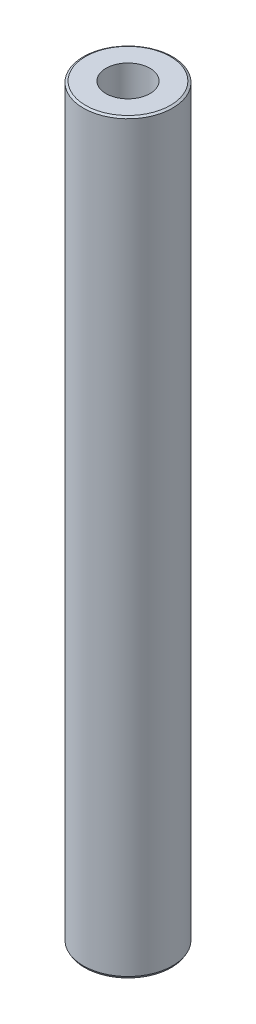
ISO-10303-21;
HEADER;
FILE_DESCRIPTION(('STEP AP214'),'2;1');
FILE_NAME('part.step','',(''),(''),'','','');
FILE_SCHEMA(('AUTOMOTIVE_DESIGN { 1 0 10303 214 1 1 1 1 }'));
ENDSEC;
DATA;
#1=APPLICATION_CONTEXT('core data for automotive mechanical design processes');
#2=APPLICATION_PROTOCOL_DEFINITION('international standard','automotive_design',2000,#1);
#3=PRODUCT_CONTEXT('',#1,'mechanical');
#4=PRODUCT('Part','Part','',(#3));
#5=PRODUCT_RELATED_PRODUCT_CATEGORY('part','',(#4));
#6=PRODUCT_DEFINITION_FORMATION('','',#4);
#7=PRODUCT_DEFINITION_CONTEXT('part definition',#1,'design');
#8=PRODUCT_DEFINITION('design','',#6,#7);
#9=PRODUCT_DEFINITION_SHAPE('','',#8);
#10=(LENGTH_UNIT() NAMED_UNIT(*) SI_UNIT(.MILLI.,.METRE.));
#11=(NAMED_UNIT(*) PLANE_ANGLE_UNIT() SI_UNIT($,.RADIAN.));
#12=(NAMED_UNIT(*) SI_UNIT($,.STERADIAN.) SOLID_ANGLE_UNIT());
#13=UNCERTAINTY_MEASURE_WITH_UNIT(LENGTH_MEASURE(1.E-05),#10,'distance_accuracy_value','');
#14=(GEOMETRIC_REPRESENTATION_CONTEXT(3) GLOBAL_UNCERTAINTY_ASSIGNED_CONTEXT((#13)) GLOBAL_UNIT_ASSIGNED_CONTEXT((#10,
#11,#12)) REPRESENTATION_CONTEXT('',''));
#15=CARTESIAN_POINT('',(0.,0.,0.));
#16=DIRECTION('',(0.,0.,1.));
#17=DIRECTION('',(1.,0.,0.));
#18=AXIS2_PLACEMENT_3D('',#15,#16,#17);
#19=CARTESIAN_POINT('',(0.,502.179161113457,0.));
#20=DIRECTION('',(0.,-1.,0.));
#21=DIRECTION('',(0.,0.,-1.));
#22=AXIS2_PLACEMENT_3D('',#19,#20,#21);
#23=CYLINDRICAL_SURFACE('',#22,30.);
#24=CARTESIAN_POINT('',(0.,501.32159175393,0.));
#25=DIRECTION('',(0.,1.,0.));
#26=DIRECTION('',(0.,0.,1.));
#27=AXIS2_PLACEMENT_3D('',#24,#25,#26);
#28=CIRCLE('',#27,30.);
#29=CARTESIAN_POINT('',(0.,501.32159175393,30.));
#30=VERTEX_POINT('',#29);
#31=EDGE_CURVE('E50',#30,#30,#28,.F.);
#32=ORIENTED_EDGE('',*,*,#31,.T.);
#33=EDGE_LOOP('',(#32));
#34=FACE_BOUND('',#33,.T.);
#35=CARTESIAN_POINT('',(0.,1.48535370171465,0.));
#36=DIRECTION('',(0.,1.,0.));
#37=DIRECTION('',(0.,0.,1.));
#38=AXIS2_PLACEMENT_3D('',#35,#36,#37);
#39=CIRCLE('',#38,30.);
#40=CARTESIAN_POINT('',(0.,1.48535370171465,30.));
#41=VERTEX_POINT('',#40);
#42=EDGE_CURVE('E51',#41,#41,#39,.T.);
#43=ORIENTED_EDGE('',*,*,#42,.T.);
#44=EDGE_LOOP('',(#43));
#45=FACE_BOUND('',#44,.T.);
#46=ADVANCED_FACE('F39',(#34,#45),#23,.T.);
#47=CARTESIAN_POINT('',(0.,502.179161113457,0.));
#48=DIRECTION('',(0.,1.,0.));
#49=DIRECTION('',(0.,0.,1.));
#50=AXIS2_PLACEMENT_3D('',#47,#48,#49);
#51=PLANE('',#50);
#52=CARTESIAN_POINT('',(0.,502.179161113457,0.));
#53=DIRECTION('',(0.,1.,0.));
#54=DIRECTION('',(0.,0.,1.));
#55=AXIS2_PLACEMENT_3D('',#52,#53,#54);
#56=CIRCLE('',#55,28.5146462982854);
#57=CARTESIAN_POINT('',(0.,502.179161113457,28.5146462982854));
#58=VERTEX_POINT('',#57);
#59=EDGE_CURVE('E54',#58,#58,#56,.T.);
#60=ORIENTED_EDGE('',*,*,#59,.T.);
#61=EDGE_LOOP('',(#60));
#62=FACE_BOUND('',#61,.T.);
#63=CARTESIAN_POINT('',(0.,502.179161113457,0.));
#64=DIRECTION('',(0.,1.,0.));
#65=DIRECTION('',(0.,0.,1.));
#66=AXIS2_PLACEMENT_3D('',#63,#64,#65);
#67=CIRCLE('',#66,14.8070598079835);
#68=CARTESIAN_POINT('',(0.,502.179161113457,14.8070598079835));
#69=VERTEX_POINT('',#68);
#70=EDGE_CURVE('E58',#69,#69,#67,.T.);
#71=ORIENTED_EDGE('',*,*,#70,.F.);
#72=EDGE_LOOP('',(#71));
#73=FACE_BOUND('',#72,.T.);
#74=ADVANCED_FACE('F69',(#62,#73),#51,.T.);
#75=CARTESIAN_POINT('',(0.,0.,0.));
#76=DIRECTION('',(0.,1.,0.));
#77=DIRECTION('',(0.,0.,1.));
#78=AXIS2_PLACEMENT_3D('',#75,#76,#77);
#79=PLANE('',#78);
#80=CARTESIAN_POINT('',(0.,0.,0.));
#81=DIRECTION('',(0.,1.,0.));
#82=DIRECTION('',(0.,0.,1.));
#83=AXIS2_PLACEMENT_3D('',#80,#81,#82);
#84=CIRCLE('',#83,29.1424306404732);
#85=CARTESIAN_POINT('',(0.,0.,29.1424306404732));
#86=VERTEX_POINT('',#85);
#87=EDGE_CURVE('E10',#86,#86,#84,.F.);
#88=ORIENTED_EDGE('',*,*,#87,.T.);
#89=EDGE_LOOP('',(#88));
#90=FACE_BOUND('',#89,.T.);
#91=CARTESIAN_POINT('',(0.,0.,0.));
#92=DIRECTION('',(0.,1.,0.));
#93=DIRECTION('',(0.,0.,1.));
#94=AXIS2_PLACEMENT_3D('',#91,#92,#93);
#95=CIRCLE('',#94,14.8070598079835);
#96=CARTESIAN_POINT('',(0.,0.,14.8070598079835));
#97=VERTEX_POINT('',#96);
#98=EDGE_CURVE('E63',#97,#97,#95,.T.);
#99=ORIENTED_EDGE('',*,*,#98,.T.);
#100=EDGE_LOOP('',(#99));
#101=FACE_BOUND('',#100,.T.);
#102=ADVANCED_FACE('F75',(#90,#101),#79,.F.);
#103=CARTESIAN_POINT('',(0.,502.179161113457,0.));
#104=DIRECTION('',(0.,-1.,0.));
#105=DIRECTION('',(0.,0.,-1.));
#106=AXIS2_PLACEMENT_3D('',#103,#104,#105);
#107=CYLINDRICAL_SURFACE('',#106,14.8070598079835);
#108=ORIENTED_EDGE('',*,*,#70,.T.);
#109=EDGE_LOOP('',(#108));
#110=FACE_BOUND('',#109,.T.);
#111=ORIENTED_EDGE('',*,*,#98,.F.);
#112=EDGE_LOOP('',(#111));
#113=FACE_BOUND('',#112,.T.);
#114=ADVANCED_FACE('F70',(#110,#113),#107,.F.);
#115=CARTESIAN_POINT('',(0.,502.179161113457,0.));
#116=DIRECTION('',(0.,-1.,0.));
#117=DIRECTION('',(0.,0.,-1.));
#118=AXIS2_PLACEMENT_3D('',#115,#116,#117);
#119=CONICAL_SURFACE('',#118,28.5146462982854,1.04719755119658);
#120=ORIENTED_EDGE('',*,*,#31,.F.);
#121=EDGE_LOOP('',(#120));
#122=FACE_BOUND('',#121,.T.);
#123=ORIENTED_EDGE('',*,*,#59,.F.);
#124=EDGE_LOOP('',(#123));
#125=FACE_BOUND('',#124,.T.);
#126=ADVANCED_FACE('F81',(#122,#125),#119,.T.);
#127=CARTESIAN_POINT('',(0.,1.48535370171465,0.));
#128=DIRECTION('',(0.,1.,0.));
#129=DIRECTION('',(0.,0.,1.));
#130=AXIS2_PLACEMENT_3D('',#127,#128,#129);
#131=CONICAL_SURFACE('',#130,30.,0.523598775598304);
#132=ORIENTED_EDGE('',*,*,#87,.F.);
#133=EDGE_LOOP('',(#132));
#134=FACE_BOUND('',#133,.T.);
#135=ORIENTED_EDGE('',*,*,#42,.F.);
#136=EDGE_LOOP('',(#135));
#137=FACE_BOUND('',#136,.T.);
#138=ADVANCED_FACE('F45',(#134,#137),#131,.T.);
#139=CLOSED_SHELL('',(#46,#74,#102,#114,#126,#138));
#140=MANIFOLD_SOLID_BREP('B2',#139);
#141=ADVANCED_BREP_SHAPE_REPRESENTATION('',(#18,#140),#14);
#142=SHAPE_DEFINITION_REPRESENTATION(#9,#141);
ENDSEC;
END-ISO-10303-21;
